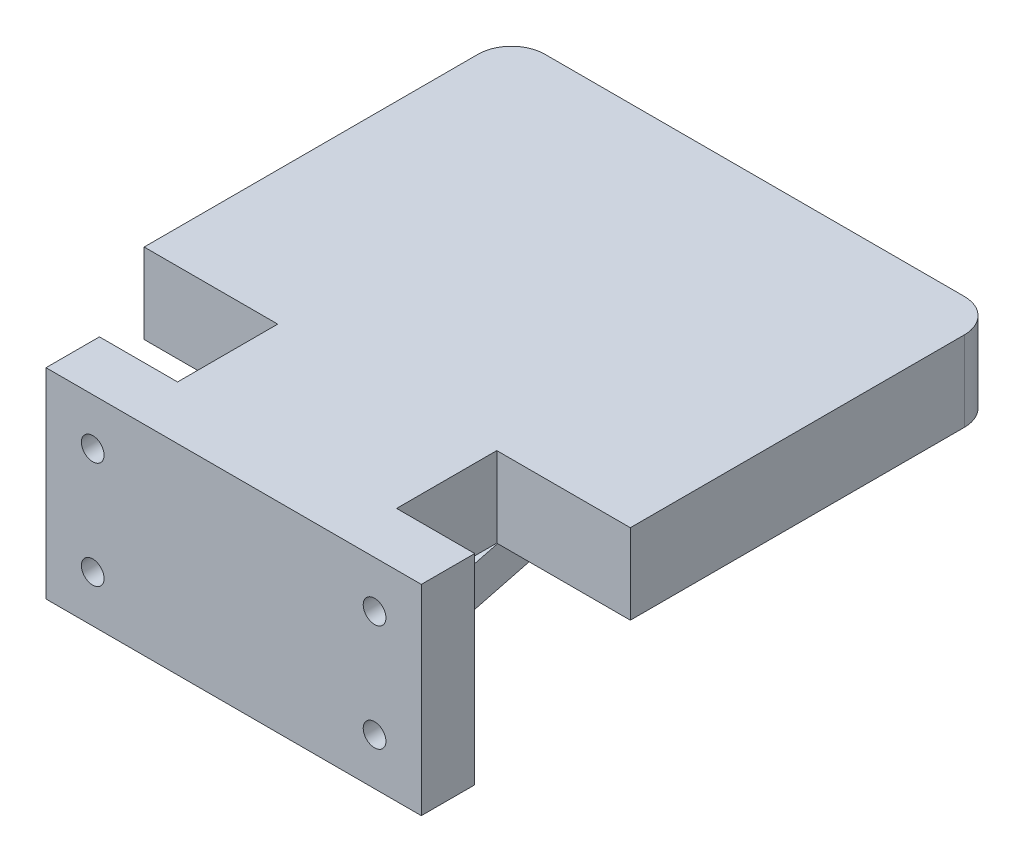
ISO-10303-21;
HEADER;
FILE_DESCRIPTION(('STEP AP214'),'2;1');
FILE_NAME('part.step','',(''),(''),'','','');
FILE_SCHEMA(('AUTOMOTIVE_DESIGN { 1 0 10303 214 1 1 1 1 }'));
ENDSEC;
DATA;
#1=APPLICATION_CONTEXT('core data for automotive mechanical design processes');
#2=APPLICATION_PROTOCOL_DEFINITION('international standard','automotive_design',2000,#1);
#3=PRODUCT_CONTEXT('',#1,'mechanical');
#4=PRODUCT('Part','Part','',(#3));
#5=PRODUCT_RELATED_PRODUCT_CATEGORY('part','',(#4));
#6=PRODUCT_DEFINITION_FORMATION('','',#4);
#7=PRODUCT_DEFINITION_CONTEXT('part definition',#1,'design');
#8=PRODUCT_DEFINITION('design','',#6,#7);
#9=PRODUCT_DEFINITION_SHAPE('','',#8);
#10=(LENGTH_UNIT() NAMED_UNIT(*) SI_UNIT(.MILLI.,.METRE.));
#11=(NAMED_UNIT(*) PLANE_ANGLE_UNIT() SI_UNIT($,.RADIAN.));
#12=(NAMED_UNIT(*) SI_UNIT($,.STERADIAN.) SOLID_ANGLE_UNIT());
#13=UNCERTAINTY_MEASURE_WITH_UNIT(LENGTH_MEASURE(1.E-05),#10,'distance_accuracy_value','');
#14=(GEOMETRIC_REPRESENTATION_CONTEXT(3) GLOBAL_UNCERTAINTY_ASSIGNED_CONTEXT((#13)) GLOBAL_UNIT_ASSIGNED_CONTEXT((#10,
#11,#12)) REPRESENTATION_CONTEXT('',''));
#15=CARTESIAN_POINT('',(0.,0.,0.));
#16=DIRECTION('',(0.,0.,1.));
#17=DIRECTION('',(1.,0.,0.));
#18=AXIS2_PLACEMENT_3D('',#15,#16,#17);
#19=CARTESIAN_POINT('',(49.1999999999998,-7.,12.8083261120685));
#20=DIRECTION('',(0.,0.,-1.));
#21=DIRECTION('',(-1.,0.,0.));
#22=AXIS2_PLACEMENT_3D('',#19,#20,#21);
#23=CYLINDRICAL_SURFACE('',#22,1.7);
#24=CARTESIAN_POINT('',(49.1999999999998,-7.,8.));
#25=DIRECTION('',(0.,0.,-1.));
#26=DIRECTION('',(-1.,0.,0.));
#27=AXIS2_PLACEMENT_3D('',#24,#25,#26);
#28=CIRCLE('',#27,1.7);
#29=CARTESIAN_POINT('',(47.4999999999998,-7.,8.));
#30=VERTEX_POINT('',#29);
#31=EDGE_CURVE('E297',#30,#30,#28,.F.);
#32=ORIENTED_EDGE('',*,*,#31,.T.);
#33=EDGE_LOOP('',(#32));
#34=FACE_BOUND('',#33,.T.);
#35=CARTESIAN_POINT('',(49.1999999999998,-7.,4.));
#36=DIRECTION('',(0.,0.,-1.));
#37=DIRECTION('',(-1.,0.,0.));
#38=AXIS2_PLACEMENT_3D('',#35,#36,#37);
#39=CIRCLE('',#38,1.7);
#40=CARTESIAN_POINT('',(47.4999999999998,-7.,4.));
#41=VERTEX_POINT('',#40);
#42=EDGE_CURVE('E39',#41,#41,#39,.F.);
#43=ORIENTED_EDGE('',*,*,#42,.F.);
#44=EDGE_LOOP('',(#43));
#45=FACE_BOUND('',#44,.T.);
#46=ADVANCED_FACE('F35',(#34,#45),#23,.F.);
#47=CARTESIAN_POINT('',(7.0000000000001,-23.0000000000001,12.8083261120685));
#48=DIRECTION('',(0.,0.,-1.));
#49=DIRECTION('',(-1.,0.,0.));
#50=AXIS2_PLACEMENT_3D('',#47,#48,#49);
#51=CYLINDRICAL_SURFACE('',#50,1.70000000000001);
#52=CARTESIAN_POINT('',(7.0000000000001,-23.0000000000001,8.));
#53=DIRECTION('',(0.,0.,-1.));
#54=DIRECTION('',(-1.,0.,0.));
#55=AXIS2_PLACEMENT_3D('',#52,#53,#54);
#56=CIRCLE('',#55,1.70000000000001);
#57=CARTESIAN_POINT('',(5.3000000000001,-23.0000000000001,8.));
#58=VERTEX_POINT('',#57);
#59=EDGE_CURVE('E298',#58,#58,#56,.F.);
#60=ORIENTED_EDGE('',*,*,#59,.T.);
#61=EDGE_LOOP('',(#60));
#62=FACE_BOUND('',#61,.T.);
#63=CARTESIAN_POINT('',(7.0000000000001,-23.0000000000001,4.));
#64=DIRECTION('',(0.,0.,-1.));
#65=DIRECTION('',(-1.,0.,0.));
#66=AXIS2_PLACEMENT_3D('',#63,#64,#65);
#67=CIRCLE('',#66,1.70000000000001);
#68=CARTESIAN_POINT('',(5.3000000000001,-23.0000000000001,4.));
#69=VERTEX_POINT('',#68);
#70=EDGE_CURVE('E341',#69,#69,#67,.F.);
#71=ORIENTED_EDGE('',*,*,#70,.F.);
#72=EDGE_LOOP('',(#71));
#73=FACE_BOUND('',#72,.T.);
#74=ADVANCED_FACE('F448',(#62,#73),#51,.F.);
#75=CARTESIAN_POINT('',(18.1,0.,0.));
#76=DIRECTION('',(1.,0.,0.));
#77=DIRECTION('',(0.,0.,-1.));
#78=AXIS2_PLACEMENT_3D('',#75,#76,#77);
#79=PLANE('',#78);
#80=DIRECTION('',(0.,1.,0.));
#81=VECTOR('',#80,1.);
#82=CARTESIAN_POINT('',(18.1,-12.,-8.));
#83=LINE('',#82,#81);
#84=CARTESIAN_POINT('',(18.1,-22.,-8.));
#85=VERTEX_POINT('',#84);
#86=CARTESIAN_POINT('',(18.1,-12.,-8.));
#87=VERTEX_POINT('',#86);
#88=EDGE_CURVE('E186',#85,#87,#83,.T.);
#89=ORIENTED_EDGE('',*,*,#88,.F.);
#90=DIRECTION('',(0.,-0.249041039810618,0.96849293259685));
#91=VECTOR('',#90,1.);
#92=CARTESIAN_POINT('',(18.1,-22.,-8.));
#93=LINE('',#92,#91);
#94=CARTESIAN_POINT('',(18.1,-12.,-46.8888888888891));
#95=VERTEX_POINT('',#94);
#96=EDGE_CURVE('E189',#95,#85,#93,.T.);
#97=ORIENTED_EDGE('',*,*,#96,.F.);
#98=DIRECTION('',(0.,0.,1.));
#99=VECTOR('',#98,1.);
#100=CARTESIAN_POINT('',(18.1,-12.,-70.));
#101=LINE('',#100,#99);
#102=CARTESIAN_POINT('',(18.1,-12.,-70.));
#103=VERTEX_POINT('',#102);
#104=EDGE_CURVE('E195',#103,#95,#101,.T.);
#105=ORIENTED_EDGE('',*,*,#104,.F.);
#106=DIRECTION('',(0.,0.249041039810618,-0.96849293259685));
#107=VECTOR('',#106,1.);
#108=CARTESIAN_POINT('',(18.1,-30.,0.));
#109=LINE('',#108,#107);
#110=CARTESIAN_POINT('',(18.1,-30.,0.));
#111=VERTEX_POINT('',#110);
#112=EDGE_CURVE('E205',#111,#103,#109,.T.);
#113=ORIENTED_EDGE('',*,*,#112,.F.);
#114=DIRECTION('',(0.,-1.,0.));
#115=VECTOR('',#114,1.);
#116=CARTESIAN_POINT('',(18.1,-12.,0.));
#117=LINE('',#116,#115);
#118=CARTESIAN_POINT('',(18.1,-12.,0.));
#119=VERTEX_POINT('',#118);
#120=EDGE_CURVE('E194',#119,#111,#117,.T.);
#121=ORIENTED_EDGE('',*,*,#120,.F.);
#122=EDGE_CURVE('E178',#87,#119,#101,.T.);
#123=ORIENTED_EDGE('',*,*,#122,.F.);
#124=EDGE_LOOP('',(#89,#97,#105,#113,#121,#123));
#125=FACE_BOUND('',#124,.T.);
#126=ADVANCED_FACE('F192',(#125),#79,.F.);
#127=CARTESIAN_POINT('',(38.1,0.,0.));
#128=DIRECTION('',(1.,0.,0.));
#129=DIRECTION('',(0.,0.,-1.));
#130=AXIS2_PLACEMENT_3D('',#127,#128,#129);
#131=PLANE('',#130);
#132=DIRECTION('',(0.,0.249041039810618,-0.96849293259685));
#133=VECTOR('',#132,1.);
#134=CARTESIAN_POINT('',(38.1,-22.,-8.));
#135=LINE('',#134,#133);
#136=CARTESIAN_POINT('',(38.1,-22.,-8.));
#137=VERTEX_POINT('',#136);
#138=CARTESIAN_POINT('',(38.1,-12.,-46.888888888889));
#139=VERTEX_POINT('',#138);
#140=EDGE_CURVE('E182',#137,#139,#135,.T.);
#141=ORIENTED_EDGE('',*,*,#140,.F.);
#142=DIRECTION('',(0.,-1.,0.));
#143=VECTOR('',#142,1.);
#144=CARTESIAN_POINT('',(38.1,-12.,-8.));
#145=LINE('',#144,#143);
#146=CARTESIAN_POINT('',(38.1,-12.,-8.));
#147=VERTEX_POINT('',#146);
#148=EDGE_CURVE('E60',#147,#137,#145,.T.);
#149=ORIENTED_EDGE('',*,*,#148,.F.);
#150=DIRECTION('',(0.,0.,1.));
#151=VECTOR('',#150,1.);
#152=CARTESIAN_POINT('',(38.1,-12.,-70.));
#153=LINE('',#152,#151);
#154=CARTESIAN_POINT('',(38.1,-12.,0.));
#155=VERTEX_POINT('',#154);
#156=EDGE_CURVE('E181',#147,#155,#153,.T.);
#157=ORIENTED_EDGE('',*,*,#156,.T.);
#158=DIRECTION('',(0.,-1.,0.));
#159=VECTOR('',#158,1.);
#160=CARTESIAN_POINT('',(38.1,-12.,0.));
#161=LINE('',#160,#159);
#162=CARTESIAN_POINT('',(38.1,-30.,0.));
#163=VERTEX_POINT('',#162);
#164=EDGE_CURVE('E200',#155,#163,#161,.T.);
#165=ORIENTED_EDGE('',*,*,#164,.T.);
#166=DIRECTION('',(0.,0.249041039810618,-0.96849293259685));
#167=VECTOR('',#166,1.);
#168=CARTESIAN_POINT('',(38.1,-30.,0.));
#169=LINE('',#168,#167);
#170=CARTESIAN_POINT('',(38.1,-12.,-70.));
#171=VERTEX_POINT('',#170);
#172=EDGE_CURVE('E196',#163,#171,#169,.T.);
#173=ORIENTED_EDGE('',*,*,#172,.T.);
#174=EDGE_CURVE('E360',#171,#139,#153,.T.);
#175=ORIENTED_EDGE('',*,*,#174,.T.);
#176=EDGE_LOOP('',(#141,#149,#157,#165,#173,#175));
#177=FACE_BOUND('',#176,.T.);
#178=ADVANCED_FACE('F367',(#177),#131,.T.);
#179=CARTESIAN_POINT('',(0.,0.,0.));
#180=DIRECTION('',(0.,0.,1.));
#181=DIRECTION('',(1.,0.,0.));
#182=AXIS2_PLACEMENT_3D('',#179,#180,#181);
#183=PLANE('',#182);
#184=CARTESIAN_POINT('',(7.00000000000003,-23.,0.));
#185=DIRECTION('',(0.,0.,-1.));
#186=DIRECTION('',(-1.,0.,0.));
#187=AXIS2_PLACEMENT_3D('',#184,#185,#186);
#188=CIRCLE('',#187,2.6);
#189=CARTESIAN_POINT('',(4.40000000000004,-23.,0.));
#190=VERTEX_POINT('',#189);
#191=EDGE_CURVE('E539',#190,#190,#188,.T.);
#192=ORIENTED_EDGE('',*,*,#191,.F.);
#193=EDGE_LOOP('',(#192));
#194=FACE_BOUND('',#193,.T.);
#195=CARTESIAN_POINT('',(7.00000000000001,-6.99999999999999,0.));
#196=DIRECTION('',(0.,0.,-1.));
#197=DIRECTION('',(1.,0.,0.));
#198=AXIS2_PLACEMENT_3D('',#195,#196,#197);
#199=CIRCLE('',#198,2.6);
#200=CARTESIAN_POINT('',(9.6,-6.99999999999999,0.));
#201=VERTEX_POINT('',#200);
#202=EDGE_CURVE('E530',#201,#201,#199,.T.);
#203=ORIENTED_EDGE('',*,*,#202,.F.);
#204=EDGE_LOOP('',(#203));
#205=FACE_BOUND('',#204,.T.);
#206=ORIENTED_EDGE('',*,*,#120,.T.);
#207=DIRECTION('',(1.,0.,0.));
#208=VECTOR('',#207,1.);
#209=CARTESIAN_POINT('',(-2.08166817117217E-13,-30.,0.));
#210=LINE('',#209,#208);
#211=CARTESIAN_POINT('',(-2.08166817117217E-13,-30.,0.));
#212=VERTEX_POINT('',#211);
#213=EDGE_CURVE('E327',#212,#111,#210,.T.);
#214=ORIENTED_EDGE('',*,*,#213,.F.);
#215=DIRECTION('',(0.,-1.,0.));
#216=VECTOR('',#215,1.);
#217=CARTESIAN_POINT('',(0.,0.,0.));
#218=LINE('',#217,#216);
#219=CARTESIAN_POINT('',(0.,0.,0.));
#220=VERTEX_POINT('',#219);
#221=EDGE_CURVE('E324',#220,#212,#218,.T.);
#222=ORIENTED_EDGE('',*,*,#221,.F.);
#223=DIRECTION('',(-1.,0.,0.));
#224=VECTOR('',#223,1.);
#225=CARTESIAN_POINT('',(0.,0.,0.));
#226=LINE('',#225,#224);
#227=CARTESIAN_POINT('',(11.7,0.,0.));
#228=VERTEX_POINT('',#227);
#229=EDGE_CURVE('E320',#228,#220,#226,.T.);
#230=ORIENTED_EDGE('',*,*,#229,.F.);
#231=DIRECTION('',(0.,1.,0.));
#232=VECTOR('',#231,1.);
#233=CARTESIAN_POINT('',(11.7,-12.,0.));
#234=LINE('',#233,#232);
#235=CARTESIAN_POINT('',(11.7,-12.,0.));
#236=VERTEX_POINT('',#235);
#237=EDGE_CURVE('E247',#236,#228,#234,.T.);
#238=ORIENTED_EDGE('',*,*,#237,.F.);
#239=DIRECTION('',(1.,0.,0.));
#240=VECTOR('',#239,1.);
#241=CARTESIAN_POINT('',(44.4999999999998,-12.,0.));
#242=LINE('',#241,#240);
#243=EDGE_CURVE('E220',#236,#119,#242,.T.);
#244=ORIENTED_EDGE('',*,*,#243,.T.);
#245=EDGE_LOOP('',(#206,#214,#222,#230,#238,#244));
#246=FACE_BOUND('',#245,.T.);
#247=ADVANCED_FACE('F415',(#194,#205,#246),#183,.F.);
#248=CARTESIAN_POINT('',(49.1999999999998,-23.,0.));
#249=DIRECTION('',(0.,0.,-1.));
#250=DIRECTION('',(1.,0.,0.));
#251=AXIS2_PLACEMENT_3D('',#248,#249,#250);
#252=CIRCLE('',#251,2.59999999999999);
#253=CARTESIAN_POINT('',(51.7999999999998,-23.,0.));
#254=VERTEX_POINT('',#253);
#255=EDGE_CURVE('E545',#254,#254,#252,.T.);
#256=ORIENTED_EDGE('',*,*,#255,.F.);
#257=EDGE_LOOP('',(#256));
#258=FACE_BOUND('',#257,.T.);
#259=CARTESIAN_POINT('',(49.1999999999998,-7.,0.));
#260=DIRECTION('',(0.,0.,-1.));
#261=DIRECTION('',(-1.,0.,0.));
#262=AXIS2_PLACEMENT_3D('',#259,#260,#261);
#263=CIRCLE('',#262,2.6);
#264=CARTESIAN_POINT('',(46.5999999999998,-7.,0.));
#265=VERTEX_POINT('',#264);
#266=EDGE_CURVE('E353',#265,#265,#263,.T.);
#267=ORIENTED_EDGE('',*,*,#266,.F.);
#268=EDGE_LOOP('',(#267));
#269=FACE_BOUND('',#268,.T.);
#270=CARTESIAN_POINT('',(56.2,-30.,0.));
#271=VERTEX_POINT('',#270);
#272=EDGE_CURVE('E326',#163,#271,#210,.T.);
#273=ORIENTED_EDGE('',*,*,#272,.F.);
#274=ORIENTED_EDGE('',*,*,#164,.F.);
#275=CARTESIAN_POINT('',(44.4999999999998,-12.,0.));
#276=VERTEX_POINT('',#275);
#277=EDGE_CURVE('E218',#155,#276,#242,.T.);
#278=ORIENTED_EDGE('',*,*,#277,.T.);
#279=DIRECTION('',(0.,1.,0.));
#280=VECTOR('',#279,1.);
#281=CARTESIAN_POINT('',(44.4999999999998,-12.,0.));
#282=LINE('',#281,#280);
#283=CARTESIAN_POINT('',(44.4999999999998,0.,0.));
#284=VERTEX_POINT('',#283);
#285=EDGE_CURVE('E290',#276,#284,#282,.T.);
#286=ORIENTED_EDGE('',*,*,#285,.T.);
#287=CARTESIAN_POINT('',(56.1999999999998,0.,0.));
#288=VERTEX_POINT('',#287);
#289=EDGE_CURVE('E321',#288,#284,#226,.T.);
#290=ORIENTED_EDGE('',*,*,#289,.F.);
#291=DIRECTION('',(0.,1.,0.));
#292=VECTOR('',#291,1.);
#293=CARTESIAN_POINT('',(56.1999999999998,0.,0.));
#294=LINE('',#293,#292);
#295=EDGE_CURVE('E317',#271,#288,#294,.T.);
#296=ORIENTED_EDGE('',*,*,#295,.F.);
#297=EDGE_LOOP('',(#273,#274,#278,#286,#290,#296));
#298=FACE_BOUND('',#297,.T.);
#299=ADVANCED_FACE('F404',(#258,#269,#298),#183,.F.);
#300=CARTESIAN_POINT('',(56.1999999999998,0.,5.));
#301=DIRECTION('',(-1.,0.,0.));
#302=DIRECTION('',(0.,-1.,0.));
#303=AXIS2_PLACEMENT_3D('',#300,#301,#302);
#304=PLANE('',#303);
#305=ORIENTED_EDGE('',*,*,#295,.T.);
#306=DIRECTION('',(0.,0.,-1.));
#307=VECTOR('',#306,1.);
#308=CARTESIAN_POINT('',(56.1999999999998,0.,5.));
#309=LINE('',#308,#307);
#310=CARTESIAN_POINT('',(56.1999999999998,0.,8.));
#311=VERTEX_POINT('',#310);
#312=EDGE_CURVE('E11',#311,#288,#309,.T.);
#313=ORIENTED_EDGE('',*,*,#312,.F.);
#314=DIRECTION('',(0.,1.,0.));
#315=VECTOR('',#314,1.);
#316=CARTESIAN_POINT('',(56.1999999999998,0.,8.));
#317=LINE('',#316,#315);
#318=CARTESIAN_POINT('',(56.2,-29.9999999999996,8.));
#319=VERTEX_POINT('',#318);
#320=EDGE_CURVE('E314',#319,#311,#317,.T.);
#321=ORIENTED_EDGE('',*,*,#320,.F.);
#322=DIRECTION('',(0.,0.,-1.));
#323=VECTOR('',#322,1.);
#324=CARTESIAN_POINT('',(56.2,-30.,5.));
#325=LINE('',#324,#323);
#326=EDGE_CURVE('E330',#319,#271,#325,.T.);
#327=ORIENTED_EDGE('',*,*,#326,.T.);
#328=EDGE_LOOP('',(#305,#313,#321,#327));
#329=FACE_BOUND('',#328,.T.);
#330=ADVANCED_FACE('F37',(#329),#304,.F.);
#331=CARTESIAN_POINT('',(0.,0.,5.));
#332=DIRECTION('',(0.,-1.,0.));
#333=DIRECTION('',(1.,0.,0.));
#334=AXIS2_PLACEMENT_3D('',#331,#332,#333);
#335=PLANE('',#334);
#336=ORIENTED_EDGE('',*,*,#289,.T.);
#337=DIRECTION('',(0.,0.,-1.));
#338=VECTOR('',#337,1.);
#339=CARTESIAN_POINT('',(44.4999999999998,0.,0.));
#340=LINE('',#339,#338);
#341=CARTESIAN_POINT('',(44.4999999999998,0.,-15.));
#342=VERTEX_POINT('',#341);
#343=EDGE_CURVE('E250',#284,#342,#340,.T.);
#344=ORIENTED_EDGE('',*,*,#343,.T.);
#345=DIRECTION('',(1.,0.,0.));
#346=VECTOR('',#345,1.);
#347=CARTESIAN_POINT('',(44.4999999999998,0.,-15.));
#348=LINE('',#347,#346);
#349=CARTESIAN_POINT('',(64.4999999999998,0.,-15.));
#350=VERTEX_POINT('',#349);
#351=EDGE_CURVE('E253',#342,#350,#348,.T.);
#352=ORIENTED_EDGE('',*,*,#351,.T.);
#353=DIRECTION('',(0.,0.,-1.));
#354=VECTOR('',#353,1.);
#355=CARTESIAN_POINT('',(64.4999999999998,0.,-15.));
#356=LINE('',#355,#354);
#357=CARTESIAN_POINT('',(64.4999999999998,0.,-65.));
#358=VERTEX_POINT('',#357);
#359=EDGE_CURVE('E256',#350,#358,#356,.T.);
#360=ORIENTED_EDGE('',*,*,#359,.T.);
#361=CARTESIAN_POINT('',(59.4999999999998,0.,-65.));
#362=DIRECTION('',(0.,1.,0.));
#363=DIRECTION('',(0.,0.,1.));
#364=AXIS2_PLACEMENT_3D('',#361,#362,#363);
#365=CIRCLE('',#364,5.);
#366=CARTESIAN_POINT('',(59.4999999999998,0.,-70.));
#367=VERTEX_POINT('',#366);
#368=EDGE_CURVE('E259',#358,#367,#365,.T.);
#369=ORIENTED_EDGE('',*,*,#368,.T.);
#370=DIRECTION('',(-1.,0.,0.));
#371=VECTOR('',#370,1.);
#372=CARTESIAN_POINT('',(-3.3,0.,-70.));
#373=LINE('',#372,#371);
#374=CARTESIAN_POINT('',(-3.3,0.,-70.));
#375=VERTEX_POINT('',#374);
#376=EDGE_CURVE('E262',#367,#375,#373,.T.);
#377=ORIENTED_EDGE('',*,*,#376,.T.);
#378=CARTESIAN_POINT('',(-3.3,0.,-65.));
#379=DIRECTION('',(0.,1.,0.));
#380=DIRECTION('',(0.,0.,-1.));
#381=AXIS2_PLACEMENT_3D('',#378,#379,#380);
#382=CIRCLE('',#381,5.);
#383=CARTESIAN_POINT('',(-8.3,0.,-65.));
#384=VERTEX_POINT('',#383);
#385=EDGE_CURVE('E265',#375,#384,#382,.T.);
#386=ORIENTED_EDGE('',*,*,#385,.T.);
#387=DIRECTION('',(0.,0.,1.));
#388=VECTOR('',#387,1.);
#389=CARTESIAN_POINT('',(-8.3,0.,-15.));
#390=LINE('',#389,#388);
#391=CARTESIAN_POINT('',(-8.3,0.,-15.));
#392=VERTEX_POINT('',#391);
#393=EDGE_CURVE('E268',#384,#392,#390,.T.);
#394=ORIENTED_EDGE('',*,*,#393,.T.);
#395=DIRECTION('',(1.,0.,0.));
#396=VECTOR('',#395,1.);
#397=CARTESIAN_POINT('',(11.7,0.,-15.));
#398=LINE('',#397,#396);
#399=CARTESIAN_POINT('',(11.7,0.,-15.));
#400=VERTEX_POINT('',#399);
#401=EDGE_CURVE('E219',#392,#400,#398,.T.);
#402=ORIENTED_EDGE('',*,*,#401,.T.);
#403=DIRECTION('',(0.,0.,1.));
#404=VECTOR('',#403,1.);
#405=CARTESIAN_POINT('',(11.7,0.,0.));
#406=LINE('',#405,#404);
#407=EDGE_CURVE('E212',#400,#228,#406,.T.);
#408=ORIENTED_EDGE('',*,*,#407,.T.);
#409=ORIENTED_EDGE('',*,*,#229,.T.);
#410=DIRECTION('',(0.,0.,-1.));
#411=VECTOR('',#410,1.);
#412=CARTESIAN_POINT('',(0.,0.,5.));
#413=LINE('',#412,#411);
#414=CARTESIAN_POINT('',(0.,0.,8.));
#415=VERTEX_POINT('',#414);
#416=EDGE_CURVE('E44',#415,#220,#413,.T.);
#417=ORIENTED_EDGE('',*,*,#416,.F.);
#418=DIRECTION('',(-1.,0.,0.));
#419=VECTOR('',#418,1.);
#420=CARTESIAN_POINT('',(0.,0.,8.));
#421=LINE('',#420,#419);
#422=EDGE_CURVE('E305',#311,#415,#421,.T.);
#423=ORIENTED_EDGE('',*,*,#422,.F.);
#424=ORIENTED_EDGE('',*,*,#312,.T.);
#425=EDGE_LOOP('',(#336,#344,#352,#360,#369,#377,#386,#394,#402,#408,#409,#417,#423,#424));
#426=FACE_BOUND('',#425,.T.);
#427=ADVANCED_FACE('F388',(#426),#335,.F.);
#428=CARTESIAN_POINT('',(0.,0.,5.));
#429=DIRECTION('',(1.,0.,0.));
#430=DIRECTION('',(0.,1.,0.));
#431=AXIS2_PLACEMENT_3D('',#428,#429,#430);
#432=PLANE('',#431);
#433=ORIENTED_EDGE('',*,*,#221,.T.);
#434=DIRECTION('',(0.,0.,-1.));
#435=VECTOR('',#434,1.);
#436=CARTESIAN_POINT('',(-2.08166817117217E-13,-30.,5.));
#437=LINE('',#436,#435);
#438=CARTESIAN_POINT('',(-2.08166817117217E-13,-30.,8.));
#439=VERTEX_POINT('',#438);
#440=EDGE_CURVE('E333',#439,#212,#437,.T.);
#441=ORIENTED_EDGE('',*,*,#440,.F.);
#442=DIRECTION('',(0.,-1.,0.));
#443=VECTOR('',#442,1.);
#444=CARTESIAN_POINT('',(0.,0.,8.));
#445=LINE('',#444,#443);
#446=EDGE_CURVE('E308',#415,#439,#445,.T.);
#447=ORIENTED_EDGE('',*,*,#446,.F.);
#448=ORIENTED_EDGE('',*,*,#416,.T.);
#449=EDGE_LOOP('',(#433,#441,#447,#448));
#450=FACE_BOUND('',#449,.T.);
#451=ADVANCED_FACE('F429',(#450),#432,.F.);
#452=CARTESIAN_POINT('',(-2.08166817117217E-13,-30.,5.));
#453=DIRECTION('',(0.,1.,0.));
#454=DIRECTION('',(-1.,0.,0.));
#455=AXIS2_PLACEMENT_3D('',#452,#453,#454);
#456=PLANE('',#455);
#457=ORIENTED_EDGE('',*,*,#213,.T.);
#458=DIRECTION('',(1.,0.,0.));
#459=VECTOR('',#458,1.);
#460=CARTESIAN_POINT('',(18.1,-30.,0.));
#461=LINE('',#460,#459);
#462=EDGE_CURVE('E208',#111,#163,#461,.T.);
#463=ORIENTED_EDGE('',*,*,#462,.T.);
#464=ORIENTED_EDGE('',*,*,#272,.T.);
#465=ORIENTED_EDGE('',*,*,#326,.F.);
#466=DIRECTION('',(1.,0.,0.));
#467=VECTOR('',#466,1.);
#468=CARTESIAN_POINT('',(-2.08166817117217E-13,-30.,8.));
#469=LINE('',#468,#467);
#470=EDGE_CURVE('E311',#439,#319,#469,.T.);
#471=ORIENTED_EDGE('',*,*,#470,.F.);
#472=ORIENTED_EDGE('',*,*,#440,.T.);
#473=EDGE_LOOP('',(#457,#463,#464,#465,#471,#472));
#474=FACE_BOUND('',#473,.T.);
#475=ADVANCED_FACE('F410',(#474),#456,.F.);
#476=CARTESIAN_POINT('',(0.,0.,8.));
#477=DIRECTION('',(0.,0.,-1.));
#478=DIRECTION('',(-1.,0.,0.));
#479=AXIS2_PLACEMENT_3D('',#476,#477,#478);
#480=PLANE('',#479);
#481=CARTESIAN_POINT('',(7.00000000000008,-6.99999999999992,8.));
#482=DIRECTION('',(0.,0.,-1.));
#483=DIRECTION('',(-1.,0.,0.));
#484=AXIS2_PLACEMENT_3D('',#481,#482,#483);
#485=CIRCLE('',#484,1.7);
#486=CARTESIAN_POINT('',(5.30000000000007,-6.99999999999992,8.));
#487=VERTEX_POINT('',#486);
#488=EDGE_CURVE('E294',#487,#487,#485,.F.);
#489=ORIENTED_EDGE('',*,*,#488,.F.);
#490=EDGE_LOOP('',(#489));
#491=FACE_BOUND('',#490,.T.);
#492=ORIENTED_EDGE('',*,*,#59,.F.);
#493=EDGE_LOOP('',(#492));
#494=FACE_BOUND('',#493,.T.);
#495=CARTESIAN_POINT('',(49.1999999999998,-23.,8.));
#496=DIRECTION('',(0.,0.,-1.));
#497=DIRECTION('',(-1.,0.,0.));
#498=AXIS2_PLACEMENT_3D('',#495,#496,#497);
#499=CIRCLE('',#498,1.69999999999999);
#500=CARTESIAN_POINT('',(47.4999999999998,-23.,8.));
#501=VERTEX_POINT('',#500);
#502=EDGE_CURVE('E275',#501,#501,#499,.F.);
#503=ORIENTED_EDGE('',*,*,#502,.F.);
#504=EDGE_LOOP('',(#503));
#505=FACE_BOUND('',#504,.T.);
#506=ORIENTED_EDGE('',*,*,#31,.F.);
#507=EDGE_LOOP('',(#506));
#508=FACE_BOUND('',#507,.T.);
#509=ORIENTED_EDGE('',*,*,#422,.T.);
#510=ORIENTED_EDGE('',*,*,#446,.T.);
#511=ORIENTED_EDGE('',*,*,#470,.T.);
#512=ORIENTED_EDGE('',*,*,#320,.T.);
#513=EDGE_LOOP('',(#509,#510,#511,#512));
#514=FACE_BOUND('',#513,.T.);
#515=ADVANCED_FACE('F431',(#491,#494,#505,#508,#514),#480,.F.);
#516=CARTESIAN_POINT('',(49.1999999999998,-23.,12.8083261120685));
#517=DIRECTION('',(0.,0.,-1.));
#518=DIRECTION('',(-1.,0.,0.));
#519=AXIS2_PLACEMENT_3D('',#516,#517,#518);
#520=CYLINDRICAL_SURFACE('',#519,1.69999999999999);
#521=CARTESIAN_POINT('',(49.1999999999998,-23.,4.));
#522=DIRECTION('',(0.,0.,1.));
#523=DIRECTION('',(1.,0.,0.));
#524=AXIS2_PLACEMENT_3D('',#521,#522,#523);
#525=CIRCLE('',#524,1.69999999999999);
#526=CARTESIAN_POINT('',(50.8999999999998,-23.,4.));
#527=VERTEX_POINT('',#526);
#528=EDGE_CURVE('E344',#527,#527,#525,.F.);
#529=ORIENTED_EDGE('',*,*,#528,.T.);
#530=EDGE_LOOP('',(#529));
#531=FACE_BOUND('',#530,.T.);
#532=ORIENTED_EDGE('',*,*,#502,.T.);
#533=EDGE_LOOP('',(#532));
#534=FACE_BOUND('',#533,.T.);
#535=ADVANCED_FACE('F433',(#531,#534),#520,.F.);
#536=CARTESIAN_POINT('',(7.00000000000008,-6.99999999999992,12.8083261120685));
#537=DIRECTION('',(0.,0.,-1.));
#538=DIRECTION('',(-1.,0.,0.));
#539=AXIS2_PLACEMENT_3D('',#536,#537,#538);
#540=CYLINDRICAL_SURFACE('',#539,1.7);
#541=CARTESIAN_POINT('',(7.00000000000008,-6.99999999999992,4.));
#542=DIRECTION('',(0.,0.,1.));
#543=DIRECTION('',(1.,0.,0.));
#544=AXIS2_PLACEMENT_3D('',#541,#542,#543);
#545=CIRCLE('',#544,1.7);
#546=CARTESIAN_POINT('',(8.70000000000008,-6.99999999999992,4.));
#547=VERTEX_POINT('',#546);
#548=EDGE_CURVE('E338',#547,#547,#545,.F.);
#549=ORIENTED_EDGE('',*,*,#548,.T.);
#550=EDGE_LOOP('',(#549));
#551=FACE_BOUND('',#550,.T.);
#552=ORIENTED_EDGE('',*,*,#488,.T.);
#553=EDGE_LOOP('',(#552));
#554=FACE_BOUND('',#553,.T.);
#555=ADVANCED_FACE('F440',(#551,#554),#540,.F.);
#556=CARTESIAN_POINT('',(11.7,-12.,0.));
#557=DIRECTION('',(-1.,0.,0.));
#558=DIRECTION('',(0.,0.,1.));
#559=AXIS2_PLACEMENT_3D('',#556,#557,#558);
#560=PLANE('',#559);
#561=ORIENTED_EDGE('',*,*,#407,.F.);
#562=DIRECTION('',(0.,1.,0.));
#563=VECTOR('',#562,1.);
#564=CARTESIAN_POINT('',(11.7,-12.,-15.));
#565=LINE('',#564,#563);
#566=CARTESIAN_POINT('',(11.7,-12.,-15.));
#567=VERTEX_POINT('',#566);
#568=EDGE_CURVE('E273',#567,#400,#565,.T.);
#569=ORIENTED_EDGE('',*,*,#568,.F.);
#570=DIRECTION('',(0.,0.,1.));
#571=VECTOR('',#570,1.);
#572=CARTESIAN_POINT('',(11.7,-12.,0.));
#573=LINE('',#572,#571);
#574=EDGE_CURVE('E215',#567,#236,#573,.T.);
#575=ORIENTED_EDGE('',*,*,#574,.T.);
#576=ORIENTED_EDGE('',*,*,#237,.T.);
#577=EDGE_LOOP('',(#561,#569,#575,#576));
#578=FACE_BOUND('',#577,.T.);
#579=ADVANCED_FACE('F421',(#578),#560,.T.);
#580=CARTESIAN_POINT('',(11.7,-12.,-15.));
#581=DIRECTION('',(0.,0.,1.));
#582=DIRECTION('',(1.,0.,0.));
#583=AXIS2_PLACEMENT_3D('',#580,#581,#582);
#584=PLANE('',#583);
#585=ORIENTED_EDGE('',*,*,#401,.F.);
#586=DIRECTION('',(0.,1.,0.));
#587=VECTOR('',#586,1.);
#588=CARTESIAN_POINT('',(-8.3,-12.,-15.));
#589=LINE('',#588,#587);
#590=CARTESIAN_POINT('',(-8.3,-12.,-15.));
#591=VERTEX_POINT('',#590);
#592=EDGE_CURVE('E276',#591,#392,#589,.T.);
#593=ORIENTED_EDGE('',*,*,#592,.F.);
#594=DIRECTION('',(1.,0.,0.));
#595=VECTOR('',#594,1.);
#596=CARTESIAN_POINT('',(11.7,-12.,-15.));
#597=LINE('',#596,#595);
#598=EDGE_CURVE('E244',#591,#567,#597,.T.);
#599=ORIENTED_EDGE('',*,*,#598,.T.);
#600=ORIENTED_EDGE('',*,*,#568,.T.);
#601=EDGE_LOOP('',(#585,#593,#599,#600));
#602=FACE_BOUND('',#601,.T.);
#603=ADVANCED_FACE('F424',(#602),#584,.T.);
#604=CARTESIAN_POINT('',(-8.3,-12.,-15.));
#605=DIRECTION('',(-1.,0.,0.));
#606=DIRECTION('',(0.,0.,1.));
#607=AXIS2_PLACEMENT_3D('',#604,#605,#606);
#608=PLANE('',#607);
#609=ORIENTED_EDGE('',*,*,#393,.F.);
#610=DIRECTION('',(0.,1.,0.));
#611=VECTOR('',#610,1.);
#612=CARTESIAN_POINT('',(-8.3,-12.,-65.));
#613=LINE('',#612,#611);
#614=CARTESIAN_POINT('',(-8.3,-12.,-65.));
#615=VERTEX_POINT('',#614);
#616=EDGE_CURVE('E278',#615,#384,#613,.T.);
#617=ORIENTED_EDGE('',*,*,#616,.F.);
#618=DIRECTION('',(0.,0.,1.));
#619=VECTOR('',#618,1.);
#620=CARTESIAN_POINT('',(-8.3,-12.,-15.));
#621=LINE('',#620,#619);
#622=EDGE_CURVE('E241',#615,#591,#621,.T.);
#623=ORIENTED_EDGE('',*,*,#622,.T.);
#624=ORIENTED_EDGE('',*,*,#592,.T.);
#625=EDGE_LOOP('',(#609,#617,#623,#624));
#626=FACE_BOUND('',#625,.T.);
#627=ADVANCED_FACE('F426',(#626),#608,.T.);
#628=CARTESIAN_POINT('',(-3.3,-12.,-65.));
#629=DIRECTION('',(0.,1.,0.));
#630=DIRECTION('',(0.,0.,1.));
#631=AXIS2_PLACEMENT_3D('',#628,#629,#630);
#632=CYLINDRICAL_SURFACE('',#631,5.);
#633=ORIENTED_EDGE('',*,*,#385,.F.);
#634=DIRECTION('',(0.,1.,0.));
#635=VECTOR('',#634,1.);
#636=CARTESIAN_POINT('',(-3.3,-12.,-70.));
#637=LINE('',#636,#635);
#638=CARTESIAN_POINT('',(-3.3,-12.,-70.));
#639=VERTEX_POINT('',#638);
#640=EDGE_CURVE('E280',#639,#375,#637,.T.);
#641=ORIENTED_EDGE('',*,*,#640,.F.);
#642=CARTESIAN_POINT('',(-3.3,-12.,-65.));
#643=DIRECTION('',(0.,1.,0.));
#644=DIRECTION('',(0.,0.,-1.));
#645=AXIS2_PLACEMENT_3D('',#642,#643,#644);
#646=CIRCLE('',#645,5.);
#647=EDGE_CURVE('E238',#639,#615,#646,.T.);
#648=ORIENTED_EDGE('',*,*,#647,.T.);
#649=ORIENTED_EDGE('',*,*,#616,.T.);
#650=EDGE_LOOP('',(#633,#641,#648,#649));
#651=FACE_BOUND('',#650,.T.);
#652=ADVANCED_FACE('F384',(#651),#632,.T.);
#653=CARTESIAN_POINT('',(-3.3,-12.,-70.));
#654=DIRECTION('',(0.,0.,-1.));
#655=DIRECTION('',(-1.,0.,0.));
#656=AXIS2_PLACEMENT_3D('',#653,#654,#655);
#657=PLANE('',#656);
#658=ORIENTED_EDGE('',*,*,#376,.F.);
#659=DIRECTION('',(0.,1.,0.));
#660=VECTOR('',#659,1.);
#661=CARTESIAN_POINT('',(59.4999999999998,-12.,-70.));
#662=LINE('',#661,#660);
#663=CARTESIAN_POINT('',(59.4999999999998,-12.,-70.));
#664=VERTEX_POINT('',#663);
#665=EDGE_CURVE('E282',#664,#367,#662,.T.);
#666=ORIENTED_EDGE('',*,*,#665,.F.);
#667=DIRECTION('',(-1.,0.,0.));
#668=VECTOR('',#667,1.);
#669=CARTESIAN_POINT('',(-3.3,-12.,-70.));
#670=LINE('',#669,#668);
#671=EDGE_CURVE('E235',#664,#171,#670,.T.);
#672=ORIENTED_EDGE('',*,*,#671,.T.);
#673=DIRECTION('',(1.,0.,0.));
#674=VECTOR('',#673,1.);
#675=CARTESIAN_POINT('',(18.1,-12.,-70.));
#676=LINE('',#675,#674);
#677=EDGE_CURVE('E209',#103,#171,#676,.T.);
#678=ORIENTED_EDGE('',*,*,#677,.F.);
#679=EDGE_CURVE('E234',#103,#639,#670,.T.);
#680=ORIENTED_EDGE('',*,*,#679,.T.);
#681=ORIENTED_EDGE('',*,*,#640,.T.);
#682=EDGE_LOOP('',(#658,#666,#672,#678,#680,#681));
#683=FACE_BOUND('',#682,.T.);
#684=ADVANCED_FACE('F376',(#683),#657,.T.);
#685=CARTESIAN_POINT('',(59.4999999999998,-12.,-65.));
#686=DIRECTION('',(0.,1.,0.));
#687=DIRECTION('',(0.,0.,1.));
#688=AXIS2_PLACEMENT_3D('',#685,#686,#687);
#689=CYLINDRICAL_SURFACE('',#688,5.);
#690=ORIENTED_EDGE('',*,*,#368,.F.);
#691=DIRECTION('',(0.,1.,0.));
#692=VECTOR('',#691,1.);
#693=CARTESIAN_POINT('',(64.4999999999998,-12.,-65.));
#694=LINE('',#693,#692);
#695=CARTESIAN_POINT('',(64.4999999999998,-12.,-65.));
#696=VERTEX_POINT('',#695);
#697=EDGE_CURVE('E284',#696,#358,#694,.T.);
#698=ORIENTED_EDGE('',*,*,#697,.F.);
#699=CARTESIAN_POINT('',(59.4999999999998,-12.,-65.));
#700=DIRECTION('',(0.,1.,0.));
#701=DIRECTION('',(0.,0.,1.));
#702=AXIS2_PLACEMENT_3D('',#699,#700,#701);
#703=CIRCLE('',#702,5.);
#704=EDGE_CURVE('E231',#696,#664,#703,.T.);
#705=ORIENTED_EDGE('',*,*,#704,.T.);
#706=ORIENTED_EDGE('',*,*,#665,.T.);
#707=EDGE_LOOP('',(#690,#698,#705,#706));
#708=FACE_BOUND('',#707,.T.);
#709=ADVANCED_FACE('F391',(#708),#689,.T.);
#710=CARTESIAN_POINT('',(64.4999999999998,-12.,-15.));
#711=DIRECTION('',(1.,0.,0.));
#712=DIRECTION('',(0.,0.,-1.));
#713=AXIS2_PLACEMENT_3D('',#710,#711,#712);
#714=PLANE('',#713);
#715=ORIENTED_EDGE('',*,*,#359,.F.);
#716=DIRECTION('',(0.,1.,0.));
#717=VECTOR('',#716,1.);
#718=CARTESIAN_POINT('',(64.4999999999998,-12.,-15.));
#719=LINE('',#718,#717);
#720=CARTESIAN_POINT('',(64.4999999999998,-12.,-15.));
#721=VERTEX_POINT('',#720);
#722=EDGE_CURVE('E286',#721,#350,#719,.T.);
#723=ORIENTED_EDGE('',*,*,#722,.F.);
#724=DIRECTION('',(0.,0.,-1.));
#725=VECTOR('',#724,1.);
#726=CARTESIAN_POINT('',(64.4999999999998,-12.,-15.));
#727=LINE('',#726,#725);
#728=EDGE_CURVE('E228',#721,#696,#727,.T.);
#729=ORIENTED_EDGE('',*,*,#728,.T.);
#730=ORIENTED_EDGE('',*,*,#697,.T.);
#731=EDGE_LOOP('',(#715,#723,#729,#730));
#732=FACE_BOUND('',#731,.T.);
#733=ADVANCED_FACE('F396',(#732),#714,.T.);
#734=CARTESIAN_POINT('',(44.4999999999998,-12.,-15.));
#735=DIRECTION('',(0.,0.,1.));
#736=DIRECTION('',(1.,0.,0.));
#737=AXIS2_PLACEMENT_3D('',#734,#735,#736);
#738=PLANE('',#737);
#739=ORIENTED_EDGE('',*,*,#351,.F.);
#740=DIRECTION('',(0.,1.,0.));
#741=VECTOR('',#740,1.);
#742=CARTESIAN_POINT('',(44.4999999999998,-12.,-15.));
#743=LINE('',#742,#741);
#744=CARTESIAN_POINT('',(44.4999999999998,-12.,-15.));
#745=VERTEX_POINT('',#744);
#746=EDGE_CURVE('E288',#745,#342,#743,.T.);
#747=ORIENTED_EDGE('',*,*,#746,.F.);
#748=DIRECTION('',(1.,0.,0.));
#749=VECTOR('',#748,1.);
#750=CARTESIAN_POINT('',(44.4999999999998,-12.,-15.));
#751=LINE('',#750,#749);
#752=EDGE_CURVE('E225',#745,#721,#751,.T.);
#753=ORIENTED_EDGE('',*,*,#752,.T.);
#754=ORIENTED_EDGE('',*,*,#722,.T.);
#755=EDGE_LOOP('',(#739,#747,#753,#754));
#756=FACE_BOUND('',#755,.T.);
#757=ADVANCED_FACE('F399',(#756),#738,.T.);
#758=CARTESIAN_POINT('',(44.4999999999998,-12.,0.));
#759=DIRECTION('',(1.,0.,0.));
#760=DIRECTION('',(0.,0.,-1.));
#761=AXIS2_PLACEMENT_3D('',#758,#759,#760);
#762=PLANE('',#761);
#763=ORIENTED_EDGE('',*,*,#343,.F.);
#764=ORIENTED_EDGE('',*,*,#285,.F.);
#765=DIRECTION('',(0.,0.,-1.));
#766=VECTOR('',#765,1.);
#767=CARTESIAN_POINT('',(44.4999999999998,-12.,0.));
#768=LINE('',#767,#766);
#769=EDGE_CURVE('E222',#276,#745,#768,.T.);
#770=ORIENTED_EDGE('',*,*,#769,.T.);
#771=ORIENTED_EDGE('',*,*,#746,.T.);
#772=EDGE_LOOP('',(#763,#764,#770,#771));
#773=FACE_BOUND('',#772,.T.);
#774=ADVANCED_FACE('F403',(#773),#762,.T.);
#775=CARTESIAN_POINT('',(-3.3,-12.,-65.));
#776=DIRECTION('',(0.,-1.,0.));
#777=DIRECTION('',(0.,0.,-1.));
#778=AXIS2_PLACEMENT_3D('',#775,#776,#777);
#779=PLANE('',#778);
#780=ORIENTED_EDGE('',*,*,#174,.F.);
#781=ORIENTED_EDGE('',*,*,#671,.F.);
#782=ORIENTED_EDGE('',*,*,#704,.F.);
#783=ORIENTED_EDGE('',*,*,#728,.F.);
#784=ORIENTED_EDGE('',*,*,#752,.F.);
#785=ORIENTED_EDGE('',*,*,#769,.F.);
#786=ORIENTED_EDGE('',*,*,#277,.F.);
#787=ORIENTED_EDGE('',*,*,#156,.F.);
#788=DIRECTION('',(-1.,0.,0.));
#789=VECTOR('',#788,1.);
#790=CARTESIAN_POINT('',(64.5009999999998,-12.,-8.));
#791=LINE('',#790,#789);
#792=EDGE_CURVE('E174',#147,#87,#791,.T.);
#793=ORIENTED_EDGE('',*,*,#792,.T.);
#794=ORIENTED_EDGE('',*,*,#122,.T.);
#795=ORIENTED_EDGE('',*,*,#243,.F.);
#796=ORIENTED_EDGE('',*,*,#574,.F.);
#797=ORIENTED_EDGE('',*,*,#598,.F.);
#798=ORIENTED_EDGE('',*,*,#622,.F.);
#799=ORIENTED_EDGE('',*,*,#647,.F.);
#800=ORIENTED_EDGE('',*,*,#679,.F.);
#801=ORIENTED_EDGE('',*,*,#104,.T.);
#802=DIRECTION('',(-1.,0.,0.));
#803=VECTOR('',#802,1.);
#804=CARTESIAN_POINT('',(64.5009999999998,-12.,-46.8888888888889));
#805=LINE('',#804,#803);
#806=EDGE_CURVE('E52',#139,#95,#805,.T.);
#807=ORIENTED_EDGE('',*,*,#806,.F.);
#808=EDGE_LOOP('',(#780,#781,#782,#783,#784,#785,#786,#787,#793,#794,#795,#796,#797,#798,#799,
#800,#801,#807));
#809=FACE_BOUND('',#808,.T.);
#810=ADVANCED_FACE('F176',(#809),#779,.T.);
#811=CARTESIAN_POINT('',(18.1,-30.,0.));
#812=DIRECTION('',(0.,-0.96849293259685,-0.249041039810618));
#813=DIRECTION('',(0.,0.249041039810618,-0.96849293259685));
#814=AXIS2_PLACEMENT_3D('',#811,#812,#813);
#815=PLANE('',#814);
#816=ORIENTED_EDGE('',*,*,#677,.T.);
#817=ORIENTED_EDGE('',*,*,#172,.F.);
#818=ORIENTED_EDGE('',*,*,#462,.F.);
#819=ORIENTED_EDGE('',*,*,#112,.T.);
#820=EDGE_LOOP('',(#816,#817,#818,#819));
#821=FACE_BOUND('',#820,.T.);
#822=ADVANCED_FACE('F371',(#821),#815,.T.);
#823=CARTESIAN_POINT('',(64.5009999999998,-12.,-8.));
#824=DIRECTION('',(0.,0.,-1.));
#825=DIRECTION('',(0.,1.,0.));
#826=AXIS2_PLACEMENT_3D('',#823,#824,#825);
#827=PLANE('',#826);
#828=ORIENTED_EDGE('',*,*,#148,.T.);
#829=DIRECTION('',(-1.,0.,0.));
#830=VECTOR('',#829,1.);
#831=CARTESIAN_POINT('',(64.5009999999998,-22.,-8.));
#832=LINE('',#831,#830);
#833=EDGE_CURVE('E183',#137,#85,#832,.T.);
#834=ORIENTED_EDGE('',*,*,#833,.T.);
#835=ORIENTED_EDGE('',*,*,#88,.T.);
#836=ORIENTED_EDGE('',*,*,#792,.F.);
#837=EDGE_LOOP('',(#828,#834,#835,#836));
#838=FACE_BOUND('',#837,.T.);
#839=ADVANCED_FACE('F187',(#838),#827,.T.);
#840=CARTESIAN_POINT('',(64.5009999999998,-22.,-8.));
#841=DIRECTION('',(0.,0.96849293259685,0.249041039810618));
#842=DIRECTION('',(0.,-0.249041039810618,0.96849293259685));
#843=AXIS2_PLACEMENT_3D('',#840,#841,#842);
#844=PLANE('',#843);
#845=ORIENTED_EDGE('',*,*,#140,.T.);
#846=ORIENTED_EDGE('',*,*,#806,.T.);
#847=ORIENTED_EDGE('',*,*,#96,.T.);
#848=ORIENTED_EDGE('',*,*,#833,.F.);
#849=EDGE_LOOP('',(#845,#846,#847,#848));
#850=FACE_BOUND('',#849,.T.);
#851=ADVANCED_FACE('F488',(#850),#844,.T.);
#852=CARTESIAN_POINT('',(7.00000000000001,-6.99999999999999,4.));
#853=DIRECTION('',(0.,0.,1.));
#854=DIRECTION('',(1.,0.,0.));
#855=AXIS2_PLACEMENT_3D('',#852,#853,#854);
#856=PLANE('',#855);
#857=CARTESIAN_POINT('',(7.00000000000001,-6.99999999999999,4.));
#858=DIRECTION('',(0.,0.,-1.));
#859=DIRECTION('',(1.,0.,0.));
#860=AXIS2_PLACEMENT_3D('',#857,#858,#859);
#861=CIRCLE('',#860,2.6);
#862=CARTESIAN_POINT('',(9.6,-6.99999999999999,4.));
#863=VERTEX_POINT('',#862);
#864=EDGE_CURVE('E527',#863,#863,#861,.T.);
#865=ORIENTED_EDGE('',*,*,#864,.T.);
#866=EDGE_LOOP('',(#865));
#867=FACE_BOUND('',#866,.T.);
#868=ORIENTED_EDGE('',*,*,#548,.F.);
#869=EDGE_LOOP('',(#868));
#870=FACE_BOUND('',#869,.T.);
#871=ADVANCED_FACE('F491',(#867,#870),#856,.F.);
#872=CARTESIAN_POINT('',(7.00000000000001,-6.99999999999999,4.));
#873=DIRECTION('',(0.,0.,-1.));
#874=DIRECTION('',(-1.,0.,0.));
#875=AXIS2_PLACEMENT_3D('',#872,#873,#874);
#876=CYLINDRICAL_SURFACE('',#875,2.6);
#877=ORIENTED_EDGE('',*,*,#864,.F.);
#878=EDGE_LOOP('',(#877));
#879=FACE_BOUND('',#878,.T.);
#880=ORIENTED_EDGE('',*,*,#202,.T.);
#881=EDGE_LOOP('',(#880));
#882=FACE_BOUND('',#881,.T.);
#883=ADVANCED_FACE('F515',(#879,#882),#876,.F.);
#884=CARTESIAN_POINT('',(7.00000000000003,-23.,4.));
#885=DIRECTION('',(0.,0.,-1.));
#886=DIRECTION('',(-1.,0.,0.));
#887=AXIS2_PLACEMENT_3D('',#884,#885,#886);
#888=PLANE('',#887);
#889=CARTESIAN_POINT('',(7.00000000000003,-23.,4.));
#890=DIRECTION('',(0.,0.,-1.));
#891=DIRECTION('',(-1.,0.,0.));
#892=AXIS2_PLACEMENT_3D('',#889,#890,#891);
#893=CIRCLE('',#892,2.6);
#894=CARTESIAN_POINT('',(4.40000000000004,-23.,4.));
#895=VERTEX_POINT('',#894);
#896=EDGE_CURVE('E534',#895,#895,#893,.T.);
#897=ORIENTED_EDGE('',*,*,#896,.T.);
#898=EDGE_LOOP('',(#897));
#899=FACE_BOUND('',#898,.T.);
#900=ORIENTED_EDGE('',*,*,#70,.T.);
#901=EDGE_LOOP('',(#900));
#902=FACE_BOUND('',#901,.T.);
#903=ADVANCED_FACE('F511',(#899,#902),#888,.T.);
#904=CARTESIAN_POINT('',(7.00000000000003,-23.,4.));
#905=DIRECTION('',(0.,0.,-1.));
#906=DIRECTION('',(-1.,0.,0.));
#907=AXIS2_PLACEMENT_3D('',#904,#905,#906);
#908=CYLINDRICAL_SURFACE('',#907,2.6);
#909=ORIENTED_EDGE('',*,*,#896,.F.);
#910=EDGE_LOOP('',(#909));
#911=FACE_BOUND('',#910,.T.);
#912=ORIENTED_EDGE('',*,*,#191,.T.);
#913=EDGE_LOOP('',(#912));
#914=FACE_BOUND('',#913,.T.);
#915=ADVANCED_FACE('F507',(#911,#914),#908,.F.);
#916=CARTESIAN_POINT('',(49.1999999999998,-23.,4.));
#917=DIRECTION('',(0.,0.,1.));
#918=DIRECTION('',(1.,0.,0.));
#919=AXIS2_PLACEMENT_3D('',#916,#917,#918);
#920=PLANE('',#919);
#921=CARTESIAN_POINT('',(49.1999999999998,-23.,4.));
#922=DIRECTION('',(0.,0.,-1.));
#923=DIRECTION('',(1.,0.,0.));
#924=AXIS2_PLACEMENT_3D('',#921,#922,#923);
#925=CIRCLE('',#924,2.59999999999999);
#926=CARTESIAN_POINT('',(51.7999999999998,-23.,4.));
#927=VERTEX_POINT('',#926);
#928=EDGE_CURVE('E542',#927,#927,#925,.T.);
#929=ORIENTED_EDGE('',*,*,#928,.T.);
#930=EDGE_LOOP('',(#929));
#931=FACE_BOUND('',#930,.T.);
#932=ORIENTED_EDGE('',*,*,#528,.F.);
#933=EDGE_LOOP('',(#932));
#934=FACE_BOUND('',#933,.T.);
#935=ADVANCED_FACE('F503',(#931,#934),#920,.F.);
#936=CARTESIAN_POINT('',(49.1999999999998,-23.,4.));
#937=DIRECTION('',(0.,0.,-1.));
#938=DIRECTION('',(-1.,0.,0.));
#939=AXIS2_PLACEMENT_3D('',#936,#937,#938);
#940=CYLINDRICAL_SURFACE('',#939,2.59999999999999);
#941=ORIENTED_EDGE('',*,*,#928,.F.);
#942=EDGE_LOOP('',(#941));
#943=FACE_BOUND('',#942,.T.);
#944=ORIENTED_EDGE('',*,*,#255,.T.);
#945=EDGE_LOOP('',(#944));
#946=FACE_BOUND('',#945,.T.);
#947=ADVANCED_FACE('F499',(#943,#946),#940,.F.);
#948=CARTESIAN_POINT('',(49.1999999999998,-7.,4.));
#949=DIRECTION('',(0.,0.,-1.));
#950=DIRECTION('',(-1.,0.,0.));
#951=AXIS2_PLACEMENT_3D('',#948,#949,#950);
#952=PLANE('',#951);
#953=CARTESIAN_POINT('',(49.1999999999998,-7.,4.));
#954=DIRECTION('',(0.,0.,-1.));
#955=DIRECTION('',(-1.,0.,0.));
#956=AXIS2_PLACEMENT_3D('',#953,#954,#955);
#957=CIRCLE('',#956,2.6);
#958=CARTESIAN_POINT('',(46.5999999999998,-7.,4.));
#959=VERTEX_POINT('',#958);
#960=EDGE_CURVE('E342',#959,#959,#957,.T.);
#961=ORIENTED_EDGE('',*,*,#960,.T.);
#962=EDGE_LOOP('',(#961));
#963=FACE_BOUND('',#962,.T.);
#964=ORIENTED_EDGE('',*,*,#42,.T.);
#965=EDGE_LOOP('',(#964));
#966=FACE_BOUND('',#965,.T.);
#967=ADVANCED_FACE('F495',(#963,#966),#952,.T.);
#968=CARTESIAN_POINT('',(49.1999999999998,-7.,4.));
#969=DIRECTION('',(0.,0.,-1.));
#970=DIRECTION('',(-1.,0.,0.));
#971=AXIS2_PLACEMENT_3D('',#968,#969,#970);
#972=CYLINDRICAL_SURFACE('',#971,2.6);
#973=ORIENTED_EDGE('',*,*,#960,.F.);
#974=EDGE_LOOP('',(#973));
#975=FACE_BOUND('',#974,.T.);
#976=ORIENTED_EDGE('',*,*,#266,.T.);
#977=EDGE_LOOP('',(#976));
#978=FACE_BOUND('',#977,.T.);
#979=ADVANCED_FACE('F492',(#975,#978),#972,.F.);
#980=CLOSED_SHELL('',(#46,#74,#126,#178,#247,#299,#330,#427,#451,#475,#515,#535,#555,#579,#603,
#627,#652,#684,#709,#733,#757,#774,#810,#822,#839,#851,#871,#883,#903,#915,#935,#947,#967,#979));
#981=MANIFOLD_SOLID_BREP('B2',#980);
#982=ADVANCED_BREP_SHAPE_REPRESENTATION('',(#18,#981),#14);
#983=SHAPE_DEFINITION_REPRESENTATION(#9,#982);
ENDSEC;
END-ISO-10303-21;
